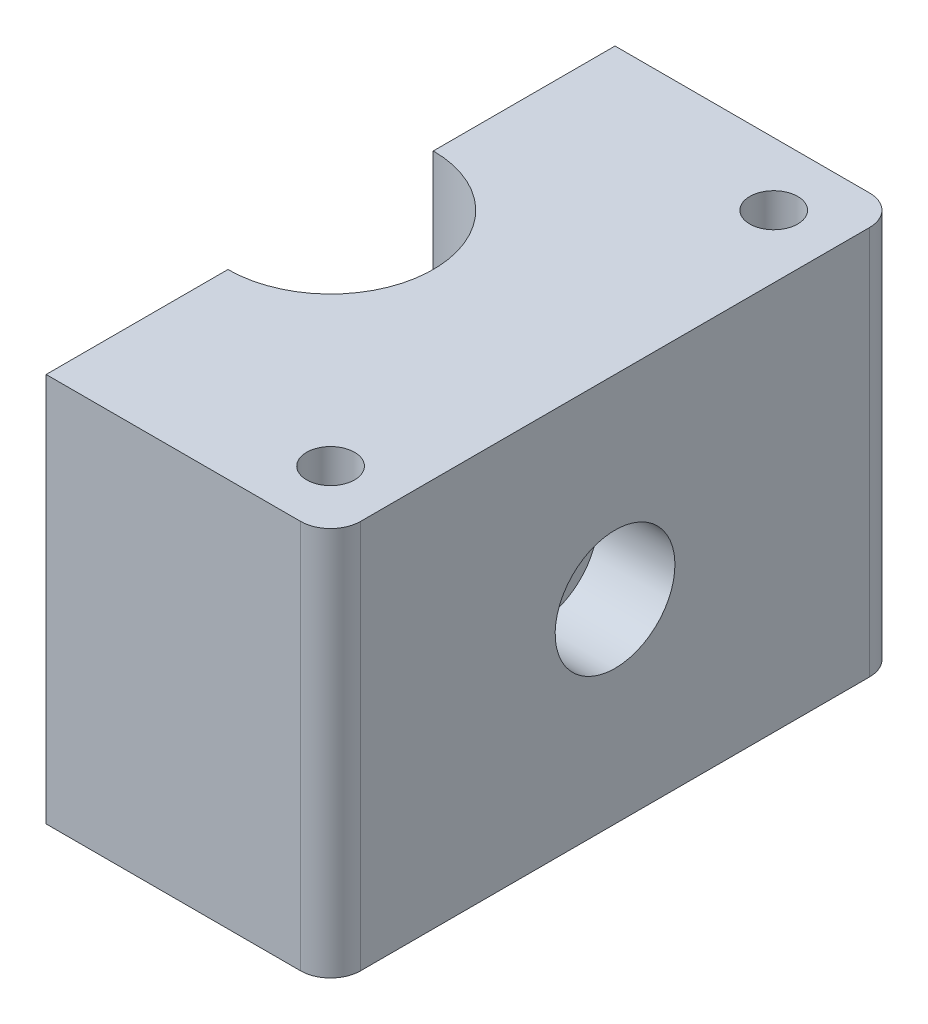
ISO-10303-21;
HEADER;
FILE_DESCRIPTION(('STEP AP214'),'2;1');
FILE_NAME('part.step','',(''),(''),'','','');
FILE_SCHEMA(('AUTOMOTIVE_DESIGN { 1 0 10303 214 1 1 1 1 }'));
ENDSEC;
DATA;
#1=APPLICATION_CONTEXT('core data for automotive mechanical design processes');
#2=APPLICATION_PROTOCOL_DEFINITION('international standard','automotive_design',2000,#1);
#3=PRODUCT_CONTEXT('',#1,'mechanical');
#4=PRODUCT('Part','Part','',(#3));
#5=PRODUCT_RELATED_PRODUCT_CATEGORY('part','',(#4));
#6=PRODUCT_DEFINITION_FORMATION('','',#4);
#7=PRODUCT_DEFINITION_CONTEXT('part definition',#1,'design');
#8=PRODUCT_DEFINITION('design','',#6,#7);
#9=PRODUCT_DEFINITION_SHAPE('','',#8);
#10=(LENGTH_UNIT() NAMED_UNIT(*) SI_UNIT(.MILLI.,.METRE.));
#11=(NAMED_UNIT(*) PLANE_ANGLE_UNIT() SI_UNIT($,.RADIAN.));
#12=(NAMED_UNIT(*) SI_UNIT($,.STERADIAN.) SOLID_ANGLE_UNIT());
#13=UNCERTAINTY_MEASURE_WITH_UNIT(LENGTH_MEASURE(1.E-05),#10,'distance_accuracy_value','');
#14=(GEOMETRIC_REPRESENTATION_CONTEXT(3) GLOBAL_UNCERTAINTY_ASSIGNED_CONTEXT((#13)) GLOBAL_UNIT_ASSIGNED_CONTEXT((#10,
#11,#12)) REPRESENTATION_CONTEXT('',''));
#15=CARTESIAN_POINT('',(0.,0.,0.));
#16=DIRECTION('',(0.,0.,1.));
#17=DIRECTION('',(1.,0.,0.));
#18=AXIS2_PLACEMENT_3D('',#15,#16,#17);
#19=CARTESIAN_POINT('',(0.,0.,0.));
#20=DIRECTION('',(1.,0.,0.));
#21=DIRECTION('',(0.,0.,-1.));
#22=AXIS2_PLACEMENT_3D('',#19,#20,#21);
#23=PLANE('',#22);
#24=DIRECTION('',(0.,0.,-1.));
#25=VECTOR('',#24,1.);
#26=CARTESIAN_POINT('',(0.,32.7450640302673,0.));
#27=LINE('',#26,#25);
#28=CARTESIAN_POINT('',(0.,32.7450640302673,12.6003906189451));
#29=VERTEX_POINT('',#28);
#30=CARTESIAN_POINT('',(0.,32.7450640302673,6.85772410593546));
#31=VERTEX_POINT('',#30);
#32=EDGE_CURVE('E329',#29,#31,#27,.T.);
#33=ORIENTED_EDGE('',*,*,#32,.F.);
#34=CARTESIAN_POINT('',(0.,30.5,0.));
#35=DIRECTION('',(1.,0.,0.));
#36=DIRECTION('',(0.,1.,0.));
#37=AXIS2_PLACEMENT_3D('',#34,#35,#36);
#38=ELLIPSE('',#37,17.9605122421382,12.7);
#39=CARTESIAN_POINT('',(0.,28.2549359697327,12.6003906189451));
#40=VERTEX_POINT('',#39);
#41=EDGE_CURVE('E332',#40,#29,#38,.F.);
#42=ORIENTED_EDGE('',*,*,#41,.F.);
#43=DIRECTION('',(0.,0.,-1.));
#44=VECTOR('',#43,1.);
#45=CARTESIAN_POINT('',(0.,28.2549359697327,0.));
#46=LINE('',#45,#44);
#47=CARTESIAN_POINT('',(0.,28.2549359697327,6.85772410593546));
#48=VERTEX_POINT('',#47);
#49=EDGE_CURVE('E353',#40,#48,#46,.T.);
#50=ORIENTED_EDGE('',*,*,#49,.T.);
#51=DIRECTION('',(0.,1.,0.));
#52=VECTOR('',#51,1.);
#53=CARTESIAN_POINT('',(0.,-1.89657287525367,6.85772410593546));
#54=LINE('',#53,#52);
#55=CARTESIAN_POINT('',(0.,19.5,6.85772410593546));
#56=VERTEX_POINT('',#55);
#57=EDGE_CURVE('E346',#56,#48,#54,.T.);
#58=ORIENTED_EDGE('',*,*,#57,.F.);
#59=DIRECTION('',(0.,-0.707106781186547,0.707106781186548));
#60=VECTOR('',#59,1.);
#61=CARTESIAN_POINT('',(0.,26.3577241059354,0.));
#62=LINE('',#61,#60);
#63=CARTESIAN_POINT('',(0.,17.5,8.85772410593546));
#64=VERTEX_POINT('',#63);
#65=EDGE_CURVE('E49',#56,#64,#62,.T.);
#66=ORIENTED_EDGE('',*,*,#65,.T.);
#67=DIRECTION('',(0.,0.,-1.));
#68=VECTOR('',#67,1.);
#69=CARTESIAN_POINT('',(0.,17.5,17.));
#70=LINE('',#69,#68);
#71=CARTESIAN_POINT('',(0.,17.5,19.));
#72=VERTEX_POINT('',#71);
#73=EDGE_CURVE('E57',#72,#64,#70,.T.);
#74=ORIENTED_EDGE('',*,*,#73,.F.);
#75=DIRECTION('',(0.,-1.,0.));
#76=VECTOR('',#75,1.);
#77=CARTESIAN_POINT('',(0.,43.5,19.));
#78=LINE('',#77,#76);
#79=CARTESIAN_POINT('',(0.,43.5,19.));
#80=VERTEX_POINT('',#79);
#81=EDGE_CURVE('E360',#80,#72,#78,.T.);
#82=ORIENTED_EDGE('',*,*,#81,.F.);
#83=DIRECTION('',(0.,0.,-1.));
#84=VECTOR('',#83,1.);
#85=CARTESIAN_POINT('',(0.,43.5,17.));
#86=LINE('',#85,#84);
#87=CARTESIAN_POINT('',(0.,43.5,6.85772410593546));
#88=VERTEX_POINT('',#87);
#89=EDGE_CURVE('E354',#80,#88,#86,.T.);
#90=ORIENTED_EDGE('',*,*,#89,.T.);
#91=DIRECTION('',(0.,1.,0.));
#92=VECTOR('',#91,1.);
#93=CARTESIAN_POINT('',(0.,-1.89657287525367,6.85772410593546));
#94=LINE('',#93,#92);
#95=EDGE_CURVE('E44',#31,#88,#94,.T.);
#96=ORIENTED_EDGE('',*,*,#95,.F.);
#97=EDGE_LOOP('',(#33,#42,#50,#58,#66,#74,#82,#90,#96));
#98=FACE_BOUND('',#97,.T.);
#99=ADVANCED_FACE('F41',(#98),#23,.F.);
#100=CARTESIAN_POINT('',(0.,43.5,-6.85772410593546));
#101=VERTEX_POINT('',#100);
#102=CARTESIAN_POINT('',(0.,43.5,-19.));
#103=VERTEX_POINT('',#102);
#104=EDGE_CURVE('E351',#101,#103,#86,.T.);
#105=ORIENTED_EDGE('',*,*,#104,.T.);
#106=DIRECTION('',(0.,1.,0.));
#107=VECTOR('',#106,1.);
#108=CARTESIAN_POINT('',(0.,43.5,-19.));
#109=LINE('',#108,#107);
#110=CARTESIAN_POINT('',(0.,17.5,-19.));
#111=VERTEX_POINT('',#110);
#112=EDGE_CURVE('E361',#111,#103,#109,.T.);
#113=ORIENTED_EDGE('',*,*,#112,.F.);
#114=CARTESIAN_POINT('',(0.,17.5,-8.85772410593546));
#115=VERTEX_POINT('',#114);
#116=EDGE_CURVE('E358',#115,#111,#70,.T.);
#117=ORIENTED_EDGE('',*,*,#116,.F.);
#118=DIRECTION('',(0.,0.707106781186547,0.707106781186548));
#119=VECTOR('',#118,1.);
#120=CARTESIAN_POINT('',(0.,26.3577241059354,0.));
#121=LINE('',#120,#119);
#122=CARTESIAN_POINT('',(0.,19.5,-6.85772410593546));
#123=VERTEX_POINT('',#122);
#124=EDGE_CURVE('E11',#115,#123,#121,.T.);
#125=ORIENTED_EDGE('',*,*,#124,.T.);
#126=DIRECTION('',(0.,1.,0.));
#127=VECTOR('',#126,1.);
#128=CARTESIAN_POINT('',(0.,-1.89657287525367,-6.85772410593546));
#129=LINE('',#128,#127);
#130=CARTESIAN_POINT('',(0.,28.2549359697327,-6.85772410593546));
#131=VERTEX_POINT('',#130);
#132=EDGE_CURVE('E359',#131,#123,#129,.F.);
#133=ORIENTED_EDGE('',*,*,#132,.F.);
#134=CARTESIAN_POINT('',(0.,28.2549359697327,-12.6003906189451));
#135=VERTEX_POINT('',#134);
#136=EDGE_CURVE('E349',#131,#135,#46,.T.);
#137=ORIENTED_EDGE('',*,*,#136,.T.);
#138=CARTESIAN_POINT('',(0.,32.7450640302673,-12.6003906189451));
#139=VERTEX_POINT('',#138);
#140=EDGE_CURVE('E343',#139,#135,#38,.F.);
#141=ORIENTED_EDGE('',*,*,#140,.F.);
#142=CARTESIAN_POINT('',(0.,32.7450640302673,-6.85772410593546));
#143=VERTEX_POINT('',#142);
#144=EDGE_CURVE('E268',#143,#139,#27,.T.);
#145=ORIENTED_EDGE('',*,*,#144,.F.);
#146=DIRECTION('',(0.,1.,0.));
#147=VECTOR('',#146,1.);
#148=CARTESIAN_POINT('',(0.,-1.89657287525367,-6.85772410593546));
#149=LINE('',#148,#147);
#150=EDGE_CURVE('E356',#101,#143,#149,.F.);
#151=ORIENTED_EDGE('',*,*,#150,.F.);
#152=EDGE_LOOP('',(#105,#113,#117,#125,#133,#137,#141,#145,#151));
#153=FACE_BOUND('',#152,.T.);
#154=ADVANCED_FACE('F292',(#153),#23,.F.);
#155=CARTESIAN_POINT('',(12.8577241059355,30.5,0.));
#156=DIRECTION('',(1.,0.,0.));
#157=DIRECTION('',(0.,1.,0.));
#158=AXIS2_PLACEMENT_3D('',#155,#156,#157);
#159=PLANE('',#158);
#160=CARTESIAN_POINT('',(12.8577241059355,30.5,0.));
#161=DIRECTION('',(1.,0.,0.));
#162=DIRECTION('',(0.,1.,0.));
#163=AXIS2_PLACEMENT_3D('',#160,#161,#162);
#164=CIRCLE('',#163,2.5);
#165=CARTESIAN_POINT('',(12.8577241059355,33.,0.));
#166=VERTEX_POINT('',#165);
#167=EDGE_CURVE('E212',#166,#166,#164,.F.);
#168=ORIENTED_EDGE('',*,*,#167,.T.);
#169=EDGE_LOOP('',(#168));
#170=FACE_BOUND('',#169,.T.);
#171=CARTESIAN_POINT('',(12.8577241059355,30.5,0.));
#172=DIRECTION('',(-1.,0.,0.));
#173=DIRECTION('',(0.,1.,0.));
#174=AXIS2_PLACEMENT_3D('',#171,#172,#173);
#175=CIRCLE('',#174,3.);
#176=CARTESIAN_POINT('',(12.8577241059355,33.4580398915498,-0.5));
#177=VERTEX_POINT('',#176);
#178=CARTESIAN_POINT('',(12.8577241059355,33.4580398915498,0.5));
#179=VERTEX_POINT('',#178);
#180=EDGE_CURVE('E190',#177,#179,#175,.T.);
#181=ORIENTED_EDGE('',*,*,#180,.F.);
#182=DIRECTION('',(0.,-1.,0.));
#183=VECTOR('',#182,1.);
#184=CARTESIAN_POINT('',(12.8577241059355,33.4580398915498,-0.5));
#185=LINE('',#184,#183);
#186=CARTESIAN_POINT('',(12.8577241059355,34.4686269665969,-0.5));
#187=VERTEX_POINT('',#186);
#188=EDGE_CURVE('E199',#187,#177,#185,.T.);
#189=ORIENTED_EDGE('',*,*,#188,.F.);
#190=CARTESIAN_POINT('',(12.8577241059355,30.5,0.));
#191=DIRECTION('',(-1.,0.,0.));
#192=DIRECTION('',(0.,-1.,0.));
#193=AXIS2_PLACEMENT_3D('',#190,#191,#192);
#194=CIRCLE('',#193,3.99999999999999);
#195=CARTESIAN_POINT('',(12.8577241059355,34.4686269665969,0.5));
#196=VERTEX_POINT('',#195);
#197=EDGE_CURVE('E170',#196,#187,#194,.T.);
#198=ORIENTED_EDGE('',*,*,#197,.F.);
#199=DIRECTION('',(0.,1.,0.));
#200=VECTOR('',#199,1.);
#201=CARTESIAN_POINT('',(12.8577241059355,33.4580398915498,0.5));
#202=LINE('',#201,#200);
#203=EDGE_CURVE('E187',#179,#196,#202,.T.);
#204=ORIENTED_EDGE('',*,*,#203,.F.);
#205=EDGE_LOOP('',(#181,#189,#198,#204));
#206=FACE_BOUND('',#205,.T.);
#207=ADVANCED_FACE('F288',(#170,#206),#159,.T.);
#208=CARTESIAN_POINT('',(12.8577241059355,30.5,0.));
#209=DIRECTION('',(-1.,0.,0.));
#210=DIRECTION('',(0.,-1.,0.));
#211=AXIS2_PLACEMENT_3D('',#208,#209,#210);
#212=CYLINDRICAL_SURFACE('',#211,3.99999999999999);
#213=CARTESIAN_POINT('',(19.,30.5,0.));
#214=DIRECTION('',(-1.,0.,0.));
#215=DIRECTION('',(0.,-1.,0.));
#216=AXIS2_PLACEMENT_3D('',#213,#214,#215);
#217=CIRCLE('',#216,3.99999999999999);
#218=CARTESIAN_POINT('',(19.,26.5,0.));
#219=VERTEX_POINT('',#218);
#220=EDGE_CURVE('E209',#219,#219,#217,.T.);
#221=ORIENTED_EDGE('',*,*,#220,.F.);
#222=EDGE_LOOP('',(#221));
#223=FACE_BOUND('',#222,.T.);
#224=ORIENTED_EDGE('',*,*,#197,.T.);
#225=DIRECTION('',(-1.,0.,0.));
#226=VECTOR('',#225,1.);
#227=CARTESIAN_POINT('',(13.8577241059355,34.4686269665969,-0.5));
#228=LINE('',#227,#226);
#229=CARTESIAN_POINT('',(13.8577241059355,34.4686269665969,-0.5));
#230=VERTEX_POINT('',#229);
#231=EDGE_CURVE('E163',#230,#187,#228,.T.);
#232=ORIENTED_EDGE('',*,*,#231,.F.);
#233=CARTESIAN_POINT('',(13.8577241059355,30.5,0.));
#234=DIRECTION('',(1.,0.,0.));
#235=DIRECTION('',(0.,1.,0.));
#236=AXIS2_PLACEMENT_3D('',#233,#234,#235);
#237=CIRCLE('',#236,3.99999999999999);
#238=CARTESIAN_POINT('',(13.8577241059355,34.4686269665969,0.5));
#239=VERTEX_POINT('',#238);
#240=EDGE_CURVE('E167',#239,#230,#237,.T.);
#241=ORIENTED_EDGE('',*,*,#240,.F.);
#242=DIRECTION('',(-1.,0.,0.));
#243=VECTOR('',#242,1.);
#244=CARTESIAN_POINT('',(13.8577241059355,34.4686269665969,0.5));
#245=LINE('',#244,#243);
#246=EDGE_CURVE('E198',#239,#196,#245,.T.);
#247=ORIENTED_EDGE('',*,*,#246,.T.);
#248=EDGE_LOOP('',(#224,#232,#241,#247));
#249=FACE_BOUND('',#248,.T.);
#250=ADVANCED_FACE('F165',(#223,#249),#212,.F.);
#251=CARTESIAN_POINT('',(-7.07106781186548,30.5,0.));
#252=DIRECTION('',(1.,0.,0.));
#253=DIRECTION('',(0.,0.,-1.));
#254=AXIS2_PLACEMENT_3D('',#251,#252,#253);
#255=CYLINDRICAL_SURFACE('',#254,2.5);
#256=CARTESIAN_POINT('',(6.3857951668628,30.5,-2.5));
#257=CARTESIAN_POINT('',(6.38579176963156,30.6353169100837,-2.50000376978628));
#258=CARTESIAN_POINT('',(6.39014307204807,30.7706081924375,-2.48897688246182));
#259=CARTESIAN_POINT('',(6.40696443443333,31.0371299335398,-2.44534770352019));
#260=CARTESIAN_POINT('',(6.41943462040845,31.1683603292296,-2.41274507704396));
#261=CARTESIAN_POINT('',(6.45089747882999,31.4228431830749,-2.32730465063391));
#262=CARTESIAN_POINT('',(6.46987527620249,31.5461130802859,-2.27451296732637));
#263=CARTESIAN_POINT('',(6.51219169732241,31.7820929377026,-2.15035502439199));
#264=CARTESIAN_POINT('',(6.53553154966761,31.8947999093384,-2.07898352942396));
#265=CARTESIAN_POINT('',(6.58516959911057,32.1117429106941,-1.91610498721412));
#266=CARTESIAN_POINT('',(6.61155151386244,32.2154126388413,-1.82386898550252));
#267=CARTESIAN_POINT('',(6.66360040557058,32.4062083846025,-1.62342867560754));
#268=CARTESIAN_POINT('',(6.68926723968474,32.4933311167783,-1.51522120382143));
#269=CARTESIAN_POINT('',(6.73798234803575,32.651245846379,-1.28165217958912));
#270=CARTESIAN_POINT('',(6.76092094026506,32.7214280763518,-1.15585345003363));
#271=CARTESIAN_POINT('',(6.80059395146146,32.8394015072283,-0.893252091754849));
#272=CARTESIAN_POINT('',(6.81733039485077,32.8872000156716,-0.756453071373364));
#273=CARTESIAN_POINT('',(6.84211944268315,32.9570803127233,-0.481683956189203));
#274=CARTESIAN_POINT('',(6.85049983261011,32.9801357859099,-0.343991634775741));
#275=CARTESIAN_POINT('',(6.85880553799679,33.0029891459457,-0.0664543688486794));
#276=CARTESIAN_POINT('',(6.85873345250233,33.0027941820552,0.0733899007393719));
#277=CARTESIAN_POINT('',(6.85035441336241,32.9797324810118,0.344305270512304));
#278=CARTESIAN_POINT('',(6.84243297196507,32.9579271067177,0.475480682130771));
#279=CARTESIAN_POINT('',(6.81974527040177,32.8940410167727,0.7321638555438));
#280=CARTESIAN_POINT('',(6.80497852912786,32.8519588760023,0.857671218290568));
#281=CARTESIAN_POINT('',(6.76980981247465,32.7481888502418,1.10157470526454));
#282=CARTESIAN_POINT('',(6.74933049612425,32.6862299964819,1.21984393171936));
#283=CARTESIAN_POINT('',(6.7048246927135,32.5447004197706,1.44459368635248));
#284=CARTESIAN_POINT('',(6.68079709833728,32.4651241950591,1.55107051624397));
#285=CARTESIAN_POINT('',(6.63011001381185,32.2854423047449,1.75548429860643));
#286=CARTESIAN_POINT('',(6.60337846740516,32.1844414366714,1.85261768679997));
#287=CARTESIAN_POINT('',(6.5513792763055,31.9674043138495,2.02885991417497));
#288=CARTESIAN_POINT('',(6.52611195973719,31.8513647077256,2.10796472482486));
#289=CARTESIAN_POINT('',(6.47946288916231,31.6045387890612,2.24732463736713));
#290=CARTESIAN_POINT('',(6.45816877721588,31.4735043219327,2.30717189504217));
#291=CARTESIAN_POINT('',(6.42288832484534,31.2022380428487,2.40365473642029));
#292=CARTESIAN_POINT('',(6.40889818619187,31.0620110539998,2.44030238654951));
#293=CARTESIAN_POINT('',(6.39069599140682,30.7842441254842,2.48756834232309));
#294=CARTESIAN_POINT('',(6.38600786219048,30.6469514803456,2.49945560633754));
#295=CARTESIAN_POINT('',(6.38559695520874,30.3722830306322,2.50050739734221));
#296=CARTESIAN_POINT('',(6.38987210942483,30.2349072525488,2.48967716573752));
#297=CARTESIAN_POINT('',(6.40642477107896,29.9702810007298,2.44674958288379));
#298=CARTESIAN_POINT('',(6.41834292328799,29.8428507349089,2.41560623386284));
#299=CARTESIAN_POINT('',(6.44842047204808,29.5950735285201,2.33412211590539));
#300=CARTESIAN_POINT('',(6.4665811041881,29.4747279957779,2.28377754620907));
#301=CARTESIAN_POINT('',(6.50790526113541,29.2397097005438,2.1632694667402));
#302=CARTESIAN_POINT('',(6.53122571655637,29.1253985345179,2.0924561321242));
#303=CARTESIAN_POINT('',(6.57996790795836,28.9098285193299,1.93372337031904));
#304=CARTESIAN_POINT('',(6.60539037392098,28.8085742360439,1.84579798602242));
#305=CARTESIAN_POINT('',(6.65729474731884,28.6157682089323,1.64916053372437));
#306=CARTESIAN_POINT('',(6.68375006183657,28.5251481068272,1.53952489846873));
#307=CARTESIAN_POINT('',(6.73328338208697,28.3634936282715,1.30595102268488));
#308=CARTESIAN_POINT('',(6.75636141852393,28.2924590737551,1.18201291220497));
#309=CARTESIAN_POINT('',(6.79649498339465,28.1725219663133,0.923599475899649));
#310=CARTESIAN_POINT('',(6.81357712410545,28.1235213379593,0.789174033849027));
#311=CARTESIAN_POINT('',(6.83989373433371,28.0490832141094,0.513228825424873));
#312=CARTESIAN_POINT('',(6.84913166441466,28.023635327605,0.371712216611927));
#313=CARTESIAN_POINT('',(6.85840818806901,27.9980988636492,0.0940470145386343));
#314=CARTESIAN_POINT('',(6.85892807963691,27.9966834636074,-0.041964620287287));
#315=CARTESIAN_POINT('',(6.85194666117868,28.0158756590175,-0.312201295282263));
#316=CARTESIAN_POINT('',(6.84444623056536,28.0364808399553,-0.44642652969299));
#317=CARTESIAN_POINT('',(6.82247627625164,28.0982080611464,-0.706290379683264));
#318=CARTESIAN_POINT('',(6.80816392010177,28.1388681198124,-0.832053015546811));
#319=CARTESIAN_POINT('',(6.77405595207876,28.2391001841096,-1.07499260636168));
#320=CARTESIAN_POINT('',(6.75425930684041,28.2986757541643,-1.19216793800216));
#321=CARTESIAN_POINT('',(6.71017154975053,28.4378297829528,-1.41985114735888));
#322=CARTESIAN_POINT('',(6.68572969446697,28.5181268894827,-1.52989011188585));
#323=CARTESIAN_POINT('',(6.63537146076503,28.6952893824513,-1.73534857445178));
#324=CARTESIAN_POINT('',(6.60945457076927,28.7921605408261,-1.83076295744007));
#325=CARTESIAN_POINT('',(6.55751747901975,29.005394149087,-2.00907919003703));
#326=CARTESIAN_POINT('',(6.53155487887521,29.1224808730065,-2.0911349148913));
#327=CARTESIAN_POINT('',(6.483941821511,29.3696047135885,-2.23441306138109));
#328=CARTESIAN_POINT('',(6.46229136696334,29.4996418382756,-2.29563547010729));
#329=CARTESIAN_POINT('',(6.42572130820992,29.7719610536902,-2.39612872968383));
#330=CARTESIAN_POINT('',(6.41094741913685,29.9144382738116,-2.4349282308125));
#331=CARTESIAN_POINT('',(6.39098889978466,30.2046224966835,-2.48685458675594));
#332=CARTESIAN_POINT('',(6.38579887431515,30.3523265092746,-2.49999588597242));
#333=CARTESIAN_POINT('',(6.3857951668628,30.5,-2.5));
#334=B_SPLINE_CURVE_WITH_KNOTS('',3,(#256,#257,#258,#259,#260,#261,#262,#263,#264,#265,#266,
#267,#268,#269,#270,#271,#272,#273,#274,#275,#276,#277,#278,#279,#280,#281,#282,#283,#284,#285,
#286,#287,#288,#289,#290,#291,#292,#293,#294,#295,#296,#297,#298,#299,#300,#301,#302,#303,#304,
#305,#306,#307,#308,#309,#310,#311,#312,#313,#314,#315,#316,#317,#318,#319,#320,#321,#322,#323,
#324,#325,#326,#327,#328,#329,#330,#331,#332,#333),.UNSPECIFIED.,.T.,.F.,(4,2,2,2,2,2,2,2,2,2,2,
2,2,2,2,2,2,2,2,2,2,2,2,2,2,2,2,2,2,2,2,2,2,2,2,2,2,2,4),(0.,0.405401613807198,
0.810809519662234,1.21529685551816,1.61989828971346,2.04175596126679,2.46369730611667,
2.8991016649427,3.3343637794782,3.75178716890002,4.16908220542926,4.56684973124686,
4.96464521758437,5.36811214714667,5.77170525429756,6.19772999581775,6.62384984051942,
7.05847675178882,7.49287742165798,7.90440490759938,8.31583745591935,8.70921730880683,
9.10267506918747,9.51033594126344,9.91813898436241,10.3501289073195,10.7821149026258,
11.2121585714571,11.6420124228771,12.0480519798915,12.4540470200187,12.8510980831806,
13.2482240107665,13.6615973304861,14.0751149021369,14.5089689323513,14.9428232314019,
15.3854937193944,15.8279149320838),.UNSPECIFIED.);
#335=CARTESIAN_POINT('',(6.3857951668628,30.5,-2.5));
#336=VERTEX_POINT('',#335);
#337=EDGE_CURVE('E217',#336,#336,#334,.T.);
#338=ORIENTED_EDGE('',*,*,#337,.F.);
#339=EDGE_LOOP('',(#338));
#340=FACE_BOUND('',#339,.T.);
#341=ORIENTED_EDGE('',*,*,#167,.F.);
#342=EDGE_LOOP('',(#341));
#343=FACE_BOUND('',#342,.T.);
#344=ADVANCED_FACE('F280',(#340,#343),#255,.F.);
#345=CARTESIAN_POINT('',(-17.,43.5,19.));
#346=DIRECTION('',(0.,0.,-1.));
#347=DIRECTION('',(-1.,0.,0.));
#348=AXIS2_PLACEMENT_3D('',#345,#346,#347);
#349=PLANE('',#348);
#350=DIRECTION('',(1.,0.,0.));
#351=VECTOR('',#350,1.);
#352=CARTESIAN_POINT('',(-17.,43.5,19.));
#353=LINE('',#352,#351);
#354=CARTESIAN_POINT('',(17.,43.5,19.));
#355=VERTEX_POINT('',#354);
#356=EDGE_CURVE('E228',#80,#355,#353,.T.);
#357=ORIENTED_EDGE('',*,*,#356,.F.);
#358=ORIENTED_EDGE('',*,*,#81,.T.);
#359=DIRECTION('',(1.,0.,0.));
#360=VECTOR('',#359,1.);
#361=CARTESIAN_POINT('',(-17.,17.5,19.));
#362=LINE('',#361,#360);
#363=CARTESIAN_POINT('',(17.,17.5,19.));
#364=VERTEX_POINT('',#363);
#365=EDGE_CURVE('E225',#72,#364,#362,.T.);
#366=ORIENTED_EDGE('',*,*,#365,.T.);
#367=DIRECTION('',(0.,-1.,0.));
#368=VECTOR('',#367,1.);
#369=CARTESIAN_POINT('',(17.,43.5,19.));
#370=LINE('',#369,#368);
#371=EDGE_CURVE('E258',#355,#364,#370,.T.);
#372=ORIENTED_EDGE('',*,*,#371,.F.);
#373=EDGE_LOOP('',(#357,#358,#366,#372));
#374=FACE_BOUND('',#373,.T.);
#375=ADVANCED_FACE('F284',(#374),#349,.F.);
#376=CARTESIAN_POINT('',(17.,43.5,17.));
#377=DIRECTION('',(0.,-1.,0.));
#378=DIRECTION('',(0.,0.,-1.));
#379=AXIS2_PLACEMENT_3D('',#376,#377,#378);
#380=CYLINDRICAL_SURFACE('',#379,2.);
#381=CARTESIAN_POINT('',(17.,17.5,17.));
#382=DIRECTION('',(0.,1.,0.));
#383=DIRECTION('',(0.,0.,1.));
#384=AXIS2_PLACEMENT_3D('',#381,#382,#383);
#385=CIRCLE('',#384,2.);
#386=CARTESIAN_POINT('',(19.,17.5,17.));
#387=VERTEX_POINT('',#386);
#388=EDGE_CURVE('E242',#364,#387,#385,.T.);
#389=ORIENTED_EDGE('',*,*,#388,.T.);
#390=DIRECTION('',(0.,-1.,0.));
#391=VECTOR('',#390,1.);
#392=CARTESIAN_POINT('',(19.,43.5,17.));
#393=LINE('',#392,#391);
#394=CARTESIAN_POINT('',(19.,43.5,17.));
#395=VERTEX_POINT('',#394);
#396=EDGE_CURVE('E255',#395,#387,#393,.T.);
#397=ORIENTED_EDGE('',*,*,#396,.F.);
#398=CARTESIAN_POINT('',(17.,43.5,17.));
#399=DIRECTION('',(0.,1.,0.));
#400=DIRECTION('',(0.,0.,1.));
#401=AXIS2_PLACEMENT_3D('',#398,#399,#400);
#402=CIRCLE('',#401,2.);
#403=EDGE_CURVE('E230',#355,#395,#402,.T.);
#404=ORIENTED_EDGE('',*,*,#403,.F.);
#405=ORIENTED_EDGE('',*,*,#371,.T.);
#406=EDGE_LOOP('',(#389,#397,#404,#405));
#407=FACE_BOUND('',#406,.T.);
#408=ADVANCED_FACE('F409',(#407),#380,.T.);
#409=CARTESIAN_POINT('',(19.,43.5,17.));
#410=DIRECTION('',(-1.,0.,0.));
#411=DIRECTION('',(0.,0.,1.));
#412=AXIS2_PLACEMENT_3D('',#409,#410,#411);
#413=PLANE('',#412);
#414=ORIENTED_EDGE('',*,*,#220,.T.);
#415=EDGE_LOOP('',(#414));
#416=FACE_BOUND('',#415,.T.);
#417=DIRECTION('',(0.,0.,-1.));
#418=VECTOR('',#417,1.);
#419=CARTESIAN_POINT('',(19.,17.5,17.));
#420=LINE('',#419,#418);
#421=CARTESIAN_POINT('',(19.,17.5,-17.));
#422=VERTEX_POINT('',#421);
#423=EDGE_CURVE('E244',#387,#422,#420,.T.);
#424=ORIENTED_EDGE('',*,*,#423,.T.);
#425=DIRECTION('',(0.,-1.,0.));
#426=VECTOR('',#425,1.);
#427=CARTESIAN_POINT('',(19.,43.5,-17.));
#428=LINE('',#427,#426);
#429=CARTESIAN_POINT('',(19.,43.5,-17.));
#430=VERTEX_POINT('',#429);
#431=EDGE_CURVE('E252',#430,#422,#428,.T.);
#432=ORIENTED_EDGE('',*,*,#431,.F.);
#433=DIRECTION('',(0.,0.,-1.));
#434=VECTOR('',#433,1.);
#435=CARTESIAN_POINT('',(19.,43.5,17.));
#436=LINE('',#435,#434);
#437=EDGE_CURVE('E233',#395,#430,#436,.T.);
#438=ORIENTED_EDGE('',*,*,#437,.F.);
#439=ORIENTED_EDGE('',*,*,#396,.T.);
#440=EDGE_LOOP('',(#424,#432,#438,#439));
#441=FACE_BOUND('',#440,.T.);
#442=ADVANCED_FACE('F405',(#416,#441),#413,.F.);
#443=CARTESIAN_POINT('',(17.,43.5,-17.));
#444=DIRECTION('',(0.,-1.,0.));
#445=DIRECTION('',(0.,0.,-1.));
#446=AXIS2_PLACEMENT_3D('',#443,#444,#445);
#447=CYLINDRICAL_SURFACE('',#446,2.);
#448=CARTESIAN_POINT('',(17.,17.5,-17.));
#449=DIRECTION('',(0.,1.,0.));
#450=DIRECTION('',(0.,0.,1.));
#451=AXIS2_PLACEMENT_3D('',#448,#449,#450);
#452=CIRCLE('',#451,2.);
#453=CARTESIAN_POINT('',(17.,17.5,-19.));
#454=VERTEX_POINT('',#453);
#455=EDGE_CURVE('E246',#422,#454,#452,.T.);
#456=ORIENTED_EDGE('',*,*,#455,.T.);
#457=DIRECTION('',(0.,-1.,0.));
#458=VECTOR('',#457,1.);
#459=CARTESIAN_POINT('',(17.,43.5,-19.));
#460=LINE('',#459,#458);
#461=CARTESIAN_POINT('',(17.,43.5,-19.));
#462=VERTEX_POINT('',#461);
#463=EDGE_CURVE('E240',#462,#454,#460,.T.);
#464=ORIENTED_EDGE('',*,*,#463,.F.);
#465=CARTESIAN_POINT('',(17.,43.5,-17.));
#466=DIRECTION('',(0.,1.,0.));
#467=DIRECTION('',(0.,0.,1.));
#468=AXIS2_PLACEMENT_3D('',#465,#466,#467);
#469=CIRCLE('',#468,2.);
#470=EDGE_CURVE('E235',#430,#462,#469,.T.);
#471=ORIENTED_EDGE('',*,*,#470,.F.);
#472=ORIENTED_EDGE('',*,*,#431,.T.);
#473=EDGE_LOOP('',(#456,#464,#471,#472));
#474=FACE_BOUND('',#473,.T.);
#475=ADVANCED_FACE('F397',(#474),#447,.T.);
#476=CARTESIAN_POINT('',(17.,43.5,-19.));
#477=DIRECTION('',(0.,0.,1.));
#478=DIRECTION('',(1.,0.,0.));
#479=AXIS2_PLACEMENT_3D('',#476,#477,#478);
#480=PLANE('',#479);
#481=DIRECTION('',(-1.,0.,0.));
#482=VECTOR('',#481,1.);
#483=CARTESIAN_POINT('',(17.,17.5,-19.));
#484=LINE('',#483,#482);
#485=EDGE_CURVE('E231',#454,#111,#484,.T.);
#486=ORIENTED_EDGE('',*,*,#485,.T.);
#487=ORIENTED_EDGE('',*,*,#112,.T.);
#488=DIRECTION('',(-1.,0.,0.));
#489=VECTOR('',#488,1.);
#490=CARTESIAN_POINT('',(17.,43.5,-19.));
#491=LINE('',#490,#489);
#492=EDGE_CURVE('E237',#462,#103,#491,.T.);
#493=ORIENTED_EDGE('',*,*,#492,.F.);
#494=ORIENTED_EDGE('',*,*,#463,.T.);
#495=EDGE_LOOP('',(#486,#487,#493,#494));
#496=FACE_BOUND('',#495,.T.);
#497=ADVANCED_FACE('F386',(#496),#480,.F.);
#498=CARTESIAN_POINT('',(-17.,43.5,17.));
#499=DIRECTION('',(0.,1.,0.));
#500=DIRECTION('',(0.,0.,1.));
#501=AXIS2_PLACEMENT_3D('',#498,#499,#500);
#502=PLANE('',#501);
#503=ORIENTED_EDGE('',*,*,#89,.F.);
#504=ORIENTED_EDGE('',*,*,#356,.T.);
#505=ORIENTED_EDGE('',*,*,#403,.T.);
#506=ORIENTED_EDGE('',*,*,#437,.T.);
#507=ORIENTED_EDGE('',*,*,#470,.T.);
#508=ORIENTED_EDGE('',*,*,#492,.T.);
#509=ORIENTED_EDGE('',*,*,#104,.F.);
#510=CARTESIAN_POINT('',(0.,43.5,0.));
#511=DIRECTION('',(0.,1.,0.));
#512=DIRECTION('',(0.,0.,1.));
#513=AXIS2_PLACEMENT_3D('',#510,#511,#512);
#514=CIRCLE('',#513,6.85772410593546);
#515=EDGE_CURVE('E213',#88,#101,#514,.T.);
#516=ORIENTED_EDGE('',*,*,#515,.F.);
#517=EDGE_LOOP('',(#503,#504,#505,#506,#507,#508,#509,#516));
#518=FACE_BOUND('',#517,.T.);
#519=CARTESIAN_POINT('',(14.8,43.5,14.8));
#520=DIRECTION('',(0.,1.,0.));
#521=DIRECTION('',(0.,0.,1.));
#522=AXIS2_PLACEMENT_3D('',#519,#520,#521);
#523=CIRCLE('',#522,1.6);
#524=CARTESIAN_POINT('',(14.8,43.5,16.4));
#525=VERTEX_POINT('',#524);
#526=EDGE_CURVE('E193',#525,#525,#523,.T.);
#527=ORIENTED_EDGE('',*,*,#526,.F.);
#528=EDGE_LOOP('',(#527));
#529=FACE_BOUND('',#528,.T.);
#530=CARTESIAN_POINT('',(14.8,43.5,-14.8));
#531=DIRECTION('',(0.,1.,0.));
#532=DIRECTION('',(0.,0.,1.));
#533=AXIS2_PLACEMENT_3D('',#530,#531,#532);
#534=CIRCLE('',#533,1.6);
#535=CARTESIAN_POINT('',(14.8,43.5,-13.2));
#536=VERTEX_POINT('',#535);
#537=EDGE_CURVE('E374',#536,#536,#534,.T.);
#538=ORIENTED_EDGE('',*,*,#537,.F.);
#539=EDGE_LOOP('',(#538));
#540=FACE_BOUND('',#539,.T.);
#541=ADVANCED_FACE('F383',(#518,#529,#540),#502,.T.);
#542=CARTESIAN_POINT('',(-17.,17.5,17.));
#543=DIRECTION('',(0.,1.,0.));
#544=DIRECTION('',(0.,0.,1.));
#545=AXIS2_PLACEMENT_3D('',#542,#543,#544);
#546=PLANE('',#545);
#547=CARTESIAN_POINT('',(14.8,17.5,14.8));
#548=DIRECTION('',(0.,1.,0.));
#549=DIRECTION('',(0.,0.,1.));
#550=AXIS2_PLACEMENT_3D('',#547,#548,#549);
#551=CIRCLE('',#550,1.6);
#552=CARTESIAN_POINT('',(14.8,17.5,16.4));
#553=VERTEX_POINT('',#552);
#554=EDGE_CURVE('E372',#553,#553,#551,.T.);
#555=ORIENTED_EDGE('',*,*,#554,.T.);
#556=EDGE_LOOP('',(#555));
#557=FACE_BOUND('',#556,.T.);
#558=CARTESIAN_POINT('',(14.8,17.5,-14.8));
#559=DIRECTION('',(0.,1.,0.));
#560=DIRECTION('',(0.,0.,1.));
#561=AXIS2_PLACEMENT_3D('',#558,#559,#560);
#562=CIRCLE('',#561,1.6);
#563=CARTESIAN_POINT('',(14.8,17.5,-13.2));
#564=VERTEX_POINT('',#563);
#565=EDGE_CURVE('E375',#564,#564,#562,.T.);
#566=ORIENTED_EDGE('',*,*,#565,.T.);
#567=EDGE_LOOP('',(#566));
#568=FACE_BOUND('',#567,.T.);
#569=ORIENTED_EDGE('',*,*,#365,.F.);
#570=ORIENTED_EDGE('',*,*,#73,.T.);
#571=CARTESIAN_POINT('',(0.,17.5,0.));
#572=DIRECTION('',(0.,1.,0.));
#573=DIRECTION('',(0.,0.,1.));
#574=AXIS2_PLACEMENT_3D('',#571,#572,#573);
#575=CIRCLE('',#574,8.85772410593546);
#576=EDGE_CURVE('E266',#64,#115,#575,.T.);
#577=ORIENTED_EDGE('',*,*,#576,.T.);
#578=ORIENTED_EDGE('',*,*,#116,.T.);
#579=ORIENTED_EDGE('',*,*,#485,.F.);
#580=ORIENTED_EDGE('',*,*,#455,.F.);
#581=ORIENTED_EDGE('',*,*,#423,.F.);
#582=ORIENTED_EDGE('',*,*,#388,.F.);
#583=EDGE_LOOP('',(#569,#570,#577,#578,#579,#580,#581,#582));
#584=FACE_BOUND('',#583,.T.);
#585=ADVANCED_FACE('F385',(#557,#568,#584),#546,.F.);
#586=CARTESIAN_POINT('',(0.,-1.89657287525367,0.));
#587=DIRECTION('',(0.,1.,0.));
#588=DIRECTION('',(0.,0.,1.));
#589=AXIS2_PLACEMENT_3D('',#586,#587,#588);
#590=CYLINDRICAL_SURFACE('',#589,6.85772410593546);
#591=ORIENTED_EDGE('',*,*,#337,.T.);
#592=EDGE_LOOP('',(#591));
#593=FACE_BOUND('',#592,.T.);
#594=ORIENTED_EDGE('',*,*,#515,.T.);
#595=ORIENTED_EDGE('',*,*,#150,.T.);
#596=CARTESIAN_POINT('',(0.,32.7450640302673,0.));
#597=DIRECTION('',(0.707106781186551,0.707106781186544,0.));
#598=DIRECTION('',(-0.707106781186544,0.707106781186551,0.));
#599=AXIS2_PLACEMENT_3D('',#596,#597,#598);
#600=ELLIPSE('',#599,9.69828643762689,6.85772410593546);
#601=EDGE_CURVE('E216',#31,#143,#600,.T.);
#602=ORIENTED_EDGE('',*,*,#601,.F.);
#603=ORIENTED_EDGE('',*,*,#95,.T.);
#604=EDGE_LOOP('',(#594,#595,#602,#603));
#605=FACE_BOUND('',#604,.T.);
#606=ADVANCED_FACE('F394',(#593,#605),#590,.F.);
#607=CARTESIAN_POINT('',(0.,28.2549359697327,0.));
#608=DIRECTION('',(0.707106781186551,0.707106781186544,0.));
#609=DIRECTION('',(-0.707106781186544,0.707106781186551,0.));
#610=AXIS2_PLACEMENT_3D('',#607,#608,#609);
#611=ELLIPSE('',#610,9.69828643762689,6.85772410593546);
#612=EDGE_CURVE('E218',#48,#131,#611,.T.);
#613=ORIENTED_EDGE('',*,*,#612,.T.);
#614=ORIENTED_EDGE('',*,*,#132,.T.);
#615=CARTESIAN_POINT('',(0.,19.5,0.));
#616=DIRECTION('',(0.,1.,0.));
#617=DIRECTION('',(0.,0.,1.));
#618=AXIS2_PLACEMENT_3D('',#615,#616,#617);
#619=CIRCLE('',#618,6.85772410593546);
#620=EDGE_CURVE('E261',#123,#56,#619,.F.);
#621=ORIENTED_EDGE('',*,*,#620,.T.);
#622=ORIENTED_EDGE('',*,*,#57,.T.);
#623=EDGE_LOOP('',(#613,#614,#621,#622));
#624=FACE_BOUND('',#623,.T.);
#625=ADVANCED_FACE('F277',(#624),#590,.F.);
#626=CARTESIAN_POINT('',(-1.12253201513363,29.3774679848664,0.));
#627=DIRECTION('',(0.707106781186551,0.707106781186544,0.));
#628=DIRECTION('',(-0.707106781186544,0.707106781186551,0.));
#629=AXIS2_PLACEMENT_3D('',#626,#627,#628);
#630=CYLINDRICAL_SURFACE('',#629,12.7);
#631=CARTESIAN_POINT('',(1.12253201513367,31.6225320151337,0.));
#632=DIRECTION('',(0.707106781186551,0.707106781186544,0.));
#633=DIRECTION('',(-0.707106781186544,0.707106781186551,0.));
#634=AXIS2_PLACEMENT_3D('',#631,#632,#633);
#635=CIRCLE('',#634,12.7);
#636=EDGE_CURVE('E221',#29,#139,#635,.T.);
#637=ORIENTED_EDGE('',*,*,#636,.T.);
#638=ORIENTED_EDGE('',*,*,#140,.T.);
#639=CARTESIAN_POINT('',(-1.12253201513363,29.3774679848664,0.));
#640=DIRECTION('',(0.707106781186551,0.707106781186544,0.));
#641=DIRECTION('',(-0.707106781186544,0.707106781186551,0.));
#642=AXIS2_PLACEMENT_3D('',#639,#640,#641);
#643=CIRCLE('',#642,12.7);
#644=EDGE_CURVE('E222',#40,#135,#643,.T.);
#645=ORIENTED_EDGE('',*,*,#644,.F.);
#646=ORIENTED_EDGE('',*,*,#41,.T.);
#647=EDGE_LOOP('',(#637,#638,#645,#646));
#648=FACE_BOUND('',#647,.T.);
#649=ADVANCED_FACE('F342',(#648),#630,.F.);
#650=CARTESIAN_POINT('',(-1.12253201513363,29.3774679848664,0.));
#651=DIRECTION('',(0.707106781186551,0.707106781186544,0.));
#652=DIRECTION('',(-0.707106781186544,0.707106781186551,0.));
#653=AXIS2_PLACEMENT_3D('',#650,#651,#652);
#654=PLANE('',#653);
#655=ORIENTED_EDGE('',*,*,#49,.F.);
#656=ORIENTED_EDGE('',*,*,#644,.T.);
#657=ORIENTED_EDGE('',*,*,#136,.F.);
#658=ORIENTED_EDGE('',*,*,#612,.F.);
#659=EDGE_LOOP('',(#655,#656,#657,#658));
#660=FACE_BOUND('',#659,.T.);
#661=ADVANCED_FACE('F423',(#660),#654,.T.);
#662=CARTESIAN_POINT('',(1.12253201513367,31.6225320151337,0.));
#663=DIRECTION('',(0.707106781186551,0.707106781186544,0.));
#664=DIRECTION('',(-0.707106781186544,0.707106781186551,0.));
#665=AXIS2_PLACEMENT_3D('',#662,#663,#664);
#666=PLANE('',#665);
#667=ORIENTED_EDGE('',*,*,#636,.F.);
#668=ORIENTED_EDGE('',*,*,#32,.T.);
#669=ORIENTED_EDGE('',*,*,#601,.T.);
#670=ORIENTED_EDGE('',*,*,#144,.T.);
#671=EDGE_LOOP('',(#667,#668,#669,#670));
#672=FACE_BOUND('',#671,.T.);
#673=ADVANCED_FACE('F338',(#672),#666,.F.);
#674=CARTESIAN_POINT('',(0.,19.5,0.));
#675=DIRECTION('',(0.,-1.,0.));
#676=DIRECTION('',(0.,0.,-1.));
#677=AXIS2_PLACEMENT_3D('',#674,#675,#676);
#678=CONICAL_SURFACE('',#677,6.85772410593546,0.785398163397449);
#679=ORIENTED_EDGE('',*,*,#65,.F.);
#680=ORIENTED_EDGE('',*,*,#620,.F.);
#681=ORIENTED_EDGE('',*,*,#124,.F.);
#682=ORIENTED_EDGE('',*,*,#576,.F.);
#683=EDGE_LOOP('',(#679,#680,#681,#682));
#684=FACE_BOUND('',#683,.T.);
#685=ADVANCED_FACE('F297',(#684),#678,.F.);
#686=CARTESIAN_POINT('',(13.8577241059355,33.4580398915498,-0.5));
#687=DIRECTION('',(0.,0.,-1.));
#688=DIRECTION('',(-1.,0.,0.));
#689=AXIS2_PLACEMENT_3D('',#686,#687,#688);
#690=PLANE('',#689);
#691=ORIENTED_EDGE('',*,*,#188,.T.);
#692=DIRECTION('',(-1.,0.,0.));
#693=VECTOR('',#692,1.);
#694=CARTESIAN_POINT('',(13.8577241059355,33.4580398915498,-0.5));
#695=LINE('',#694,#693);
#696=CARTESIAN_POINT('',(13.8577241059355,33.4580398915498,-0.5));
#697=VERTEX_POINT('',#696);
#698=EDGE_CURVE('E173',#697,#177,#695,.T.);
#699=ORIENTED_EDGE('',*,*,#698,.F.);
#700=DIRECTION('',(0.,-1.,0.));
#701=VECTOR('',#700,1.);
#702=CARTESIAN_POINT('',(13.8577241059355,33.4580398915498,-0.5));
#703=LINE('',#702,#701);
#704=EDGE_CURVE('E176',#230,#697,#703,.T.);
#705=ORIENTED_EDGE('',*,*,#704,.F.);
#706=ORIENTED_EDGE('',*,*,#231,.T.);
#707=EDGE_LOOP('',(#691,#699,#705,#706));
#708=FACE_BOUND('',#707,.T.);
#709=ADVANCED_FACE('F177',(#708),#690,.F.);
#710=CARTESIAN_POINT('',(13.8577241059355,30.5,0.));
#711=DIRECTION('',(-1.,0.,0.));
#712=DIRECTION('',(0.,-1.,0.));
#713=AXIS2_PLACEMENT_3D('',#710,#711,#712);
#714=CYLINDRICAL_SURFACE('',#713,3.);
#715=ORIENTED_EDGE('',*,*,#180,.T.);
#716=DIRECTION('',(-1.,0.,0.));
#717=VECTOR('',#716,1.);
#718=CARTESIAN_POINT('',(13.8577241059355,33.4580398915498,0.5));
#719=LINE('',#718,#717);
#720=CARTESIAN_POINT('',(13.8577241059355,33.4580398915498,0.5));
#721=VERTEX_POINT('',#720);
#722=EDGE_CURVE('E204',#721,#179,#719,.T.);
#723=ORIENTED_EDGE('',*,*,#722,.F.);
#724=CARTESIAN_POINT('',(13.8577241059355,30.5,0.));
#725=DIRECTION('',(-1.,0.,0.));
#726=DIRECTION('',(0.,1.,0.));
#727=AXIS2_PLACEMENT_3D('',#724,#725,#726);
#728=CIRCLE('',#727,3.);
#729=EDGE_CURVE('E181',#697,#721,#728,.T.);
#730=ORIENTED_EDGE('',*,*,#729,.F.);
#731=ORIENTED_EDGE('',*,*,#698,.T.);
#732=EDGE_LOOP('',(#715,#723,#730,#731));
#733=FACE_BOUND('',#732,.T.);
#734=ADVANCED_FACE('F296',(#733),#714,.F.);
#735=CARTESIAN_POINT('',(13.8577241059355,33.4580398915498,0.5));
#736=DIRECTION('',(0.,0.,1.));
#737=DIRECTION('',(1.,0.,0.));
#738=AXIS2_PLACEMENT_3D('',#735,#736,#737);
#739=PLANE('',#738);
#740=ORIENTED_EDGE('',*,*,#203,.T.);
#741=ORIENTED_EDGE('',*,*,#246,.F.);
#742=DIRECTION('',(0.,1.,0.));
#743=VECTOR('',#742,1.);
#744=CARTESIAN_POINT('',(13.8577241059355,33.4580398915498,0.5));
#745=LINE('',#744,#743);
#746=EDGE_CURVE('E185',#721,#239,#745,.T.);
#747=ORIENTED_EDGE('',*,*,#746,.F.);
#748=ORIENTED_EDGE('',*,*,#722,.T.);
#749=EDGE_LOOP('',(#740,#741,#747,#748));
#750=FACE_BOUND('',#749,.T.);
#751=ADVANCED_FACE('F300',(#750),#739,.F.);
#752=CARTESIAN_POINT('',(13.8577241059355,30.5,0.));
#753=DIRECTION('',(1.,0.,0.));
#754=DIRECTION('',(0.,1.,0.));
#755=AXIS2_PLACEMENT_3D('',#752,#753,#754);
#756=PLANE('',#755);
#757=ORIENTED_EDGE('',*,*,#240,.T.);
#758=ORIENTED_EDGE('',*,*,#704,.T.);
#759=ORIENTED_EDGE('',*,*,#729,.T.);
#760=ORIENTED_EDGE('',*,*,#746,.T.);
#761=EDGE_LOOP('',(#757,#758,#759,#760));
#762=FACE_BOUND('',#761,.T.);
#763=ADVANCED_FACE('F183',(#762),#756,.T.);
#764=CARTESIAN_POINT('',(14.8,88.5,-14.8));
#765=DIRECTION('',(0.,-1.,0.));
#766=DIRECTION('',(0.,0.,-1.));
#767=AXIS2_PLACEMENT_3D('',#764,#765,#766);
#768=CYLINDRICAL_SURFACE('',#767,1.6);
#769=ORIENTED_EDGE('',*,*,#537,.T.);
#770=EDGE_LOOP('',(#769));
#771=FACE_BOUND('',#770,.T.);
#772=ORIENTED_EDGE('',*,*,#565,.F.);
#773=EDGE_LOOP('',(#772));
#774=FACE_BOUND('',#773,.T.);
#775=ADVANCED_FACE('F307',(#771,#774),#768,.F.);
#776=CARTESIAN_POINT('',(14.8,88.5,14.8));
#777=DIRECTION('',(0.,-1.,0.));
#778=DIRECTION('',(0.,0.,-1.));
#779=AXIS2_PLACEMENT_3D('',#776,#777,#778);
#780=CYLINDRICAL_SURFACE('',#779,1.6);
#781=ORIENTED_EDGE('',*,*,#526,.T.);
#782=EDGE_LOOP('',(#781));
#783=FACE_BOUND('',#782,.T.);
#784=ORIENTED_EDGE('',*,*,#554,.F.);
#785=EDGE_LOOP('',(#784));
#786=FACE_BOUND('',#785,.T.);
#787=ADVANCED_FACE('F310',(#783,#786),#780,.F.);
#788=CLOSED_SHELL('',(#99,#154,#207,#250,#344,#375,#408,#442,#475,#497,#541,#585,#606,#625,#649,
#661,#673,#685,#709,#734,#751,#763,#775,#787));
#789=MANIFOLD_SOLID_BREP('B2',#788);
#790=ADVANCED_BREP_SHAPE_REPRESENTATION('',(#18,#789),#14);
#791=SHAPE_DEFINITION_REPRESENTATION(#9,#790);
ENDSEC;
END-ISO-10303-21;
